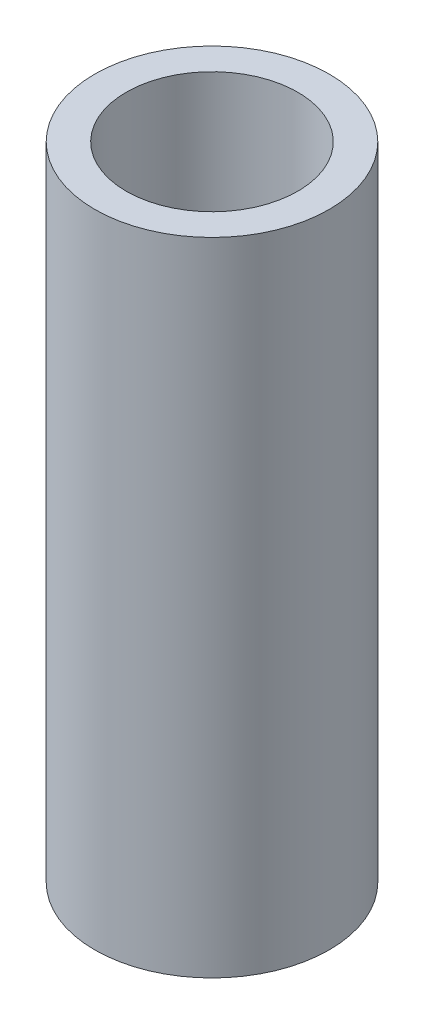
ISO-10303-21;
HEADER;
FILE_DESCRIPTION(('STEP AP214'),'2;1');
FILE_NAME('part.step','',(''),(''),'','','');
FILE_SCHEMA(('AUTOMOTIVE_DESIGN { 1 0 10303 214 1 1 1 1 }'));
ENDSEC;
DATA;
#1=APPLICATION_CONTEXT('core data for automotive mechanical design processes');
#2=APPLICATION_PROTOCOL_DEFINITION('international standard','automotive_design',2000,#1);
#3=PRODUCT_CONTEXT('',#1,'mechanical');
#4=PRODUCT('Part','Part','',(#3));
#5=PRODUCT_RELATED_PRODUCT_CATEGORY('part','',(#4));
#6=PRODUCT_DEFINITION_FORMATION('','',#4);
#7=PRODUCT_DEFINITION_CONTEXT('part definition',#1,'design');
#8=PRODUCT_DEFINITION('design','',#6,#7);
#9=PRODUCT_DEFINITION_SHAPE('','',#8);
#10=(LENGTH_UNIT() NAMED_UNIT(*) SI_UNIT(.MILLI.,.METRE.));
#11=(NAMED_UNIT(*) PLANE_ANGLE_UNIT() SI_UNIT($,.RADIAN.));
#12=(NAMED_UNIT(*) SI_UNIT($,.STERADIAN.) SOLID_ANGLE_UNIT());
#13=UNCERTAINTY_MEASURE_WITH_UNIT(LENGTH_MEASURE(1.E-05),#10,'distance_accuracy_value','');
#14=(GEOMETRIC_REPRESENTATION_CONTEXT(3) GLOBAL_UNCERTAINTY_ASSIGNED_CONTEXT((#13)) GLOBAL_UNIT_ASSIGNED_CONTEXT((#10,
#11,#12)) REPRESENTATION_CONTEXT('',''));
#15=CARTESIAN_POINT('',(0.,0.,0.));
#16=DIRECTION('',(0.,0.,1.));
#17=DIRECTION('',(1.,0.,0.));
#18=AXIS2_PLACEMENT_3D('',#15,#16,#17);
#19=CARTESIAN_POINT('',(0.,164.100641612675,0.));
#20=DIRECTION('',(0.,-1.,0.));
#21=DIRECTION('',(0.,0.,-1.));
#22=AXIS2_PLACEMENT_3D('',#19,#20,#21);
#23=CYLINDRICAL_SURFACE('',#22,30.);
#24=CARTESIAN_POINT('',(0.,164.100641612675,0.));
#25=DIRECTION('',(0.,1.,0.));
#26=DIRECTION('',(0.,0.,1.));
#27=AXIS2_PLACEMENT_3D('',#24,#25,#26);
#28=CIRCLE('',#27,30.);
#29=CARTESIAN_POINT('',(0.,164.100641612675,30.));
#30=VERTEX_POINT('',#29);
#31=EDGE_CURVE('E10',#30,#30,#28,.T.);
#32=ORIENTED_EDGE('',*,*,#31,.F.);
#33=EDGE_LOOP('',(#32));
#34=FACE_BOUND('',#33,.T.);
#35=CARTESIAN_POINT('',(0.,0.,0.));
#36=DIRECTION('',(0.,1.,0.));
#37=DIRECTION('',(0.,0.,1.));
#38=AXIS2_PLACEMENT_3D('',#35,#36,#37);
#39=CIRCLE('',#38,30.);
#40=CARTESIAN_POINT('',(0.,0.,30.));
#41=VERTEX_POINT('',#40);
#42=EDGE_CURVE('E37',#41,#41,#39,.T.);
#43=ORIENTED_EDGE('',*,*,#42,.T.);
#44=EDGE_LOOP('',(#43));
#45=FACE_BOUND('',#44,.T.);
#46=ADVANCED_FACE('F40',(#34,#45),#23,.T.);
#47=CARTESIAN_POINT('',(0.,164.100641612675,0.));
#48=DIRECTION('',(0.,1.,0.));
#49=DIRECTION('',(0.,0.,1.));
#50=AXIS2_PLACEMENT_3D('',#47,#48,#49);
#51=PLANE('',#50);
#52=CARTESIAN_POINT('',(0.,164.100641612675,0.));
#53=DIRECTION('',(0.,1.,0.));
#54=DIRECTION('',(0.,0.,1.));
#55=AXIS2_PLACEMENT_3D('',#52,#53,#54);
#56=CIRCLE('',#55,21.9542750238882);
#57=CARTESIAN_POINT('',(0.,164.100641612675,21.9542750238882));
#58=VERTEX_POINT('',#57);
#59=EDGE_CURVE('E50',#58,#58,#56,.T.);
#60=ORIENTED_EDGE('',*,*,#59,.F.);
#61=EDGE_LOOP('',(#60));
#62=FACE_BOUND('',#61,.T.);
#63=ORIENTED_EDGE('',*,*,#31,.T.);
#64=EDGE_LOOP('',(#63));
#65=FACE_BOUND('',#64,.T.);
#66=ADVANCED_FACE('F59',(#62,#65),#51,.T.);
#67=CARTESIAN_POINT('',(0.,0.,0.));
#68=DIRECTION('',(0.,1.,0.));
#69=DIRECTION('',(0.,0.,1.));
#70=AXIS2_PLACEMENT_3D('',#67,#68,#69);
#71=PLANE('',#70);
#72=CARTESIAN_POINT('',(0.,0.,0.));
#73=DIRECTION('',(0.,1.,0.));
#74=DIRECTION('',(0.,0.,1.));
#75=AXIS2_PLACEMENT_3D('',#72,#73,#74);
#76=CIRCLE('',#75,21.9542750238882);
#77=CARTESIAN_POINT('',(0.,0.,21.9542750238882));
#78=VERTEX_POINT('',#77);
#79=EDGE_CURVE('E47',#78,#78,#76,.T.);
#80=ORIENTED_EDGE('',*,*,#79,.T.);
#81=EDGE_LOOP('',(#80));
#82=FACE_BOUND('',#81,.T.);
#83=ORIENTED_EDGE('',*,*,#42,.F.);
#84=EDGE_LOOP('',(#83));
#85=FACE_BOUND('',#84,.T.);
#86=ADVANCED_FACE('F58',(#82,#85),#71,.F.);
#87=CARTESIAN_POINT('',(0.,164.100641612675,0.));
#88=DIRECTION('',(0.,-1.,0.));
#89=DIRECTION('',(0.,0.,-1.));
#90=AXIS2_PLACEMENT_3D('',#87,#88,#89);
#91=CYLINDRICAL_SURFACE('',#90,21.9542750238882);
#92=ORIENTED_EDGE('',*,*,#59,.T.);
#93=EDGE_LOOP('',(#92));
#94=FACE_BOUND('',#93,.T.);
#95=ORIENTED_EDGE('',*,*,#79,.F.);
#96=EDGE_LOOP('',(#95));
#97=FACE_BOUND('',#96,.T.);
#98=ADVANCED_FACE('F54',(#94,#97),#91,.F.);
#99=CLOSED_SHELL('',(#46,#66,#86,#98));
#100=MANIFOLD_SOLID_BREP('B2',#99);
#101=ADVANCED_BREP_SHAPE_REPRESENTATION('',(#18,#100),#14);
#102=SHAPE_DEFINITION_REPRESENTATION(#9,#101);
ENDSEC;
END-ISO-10303-21;
